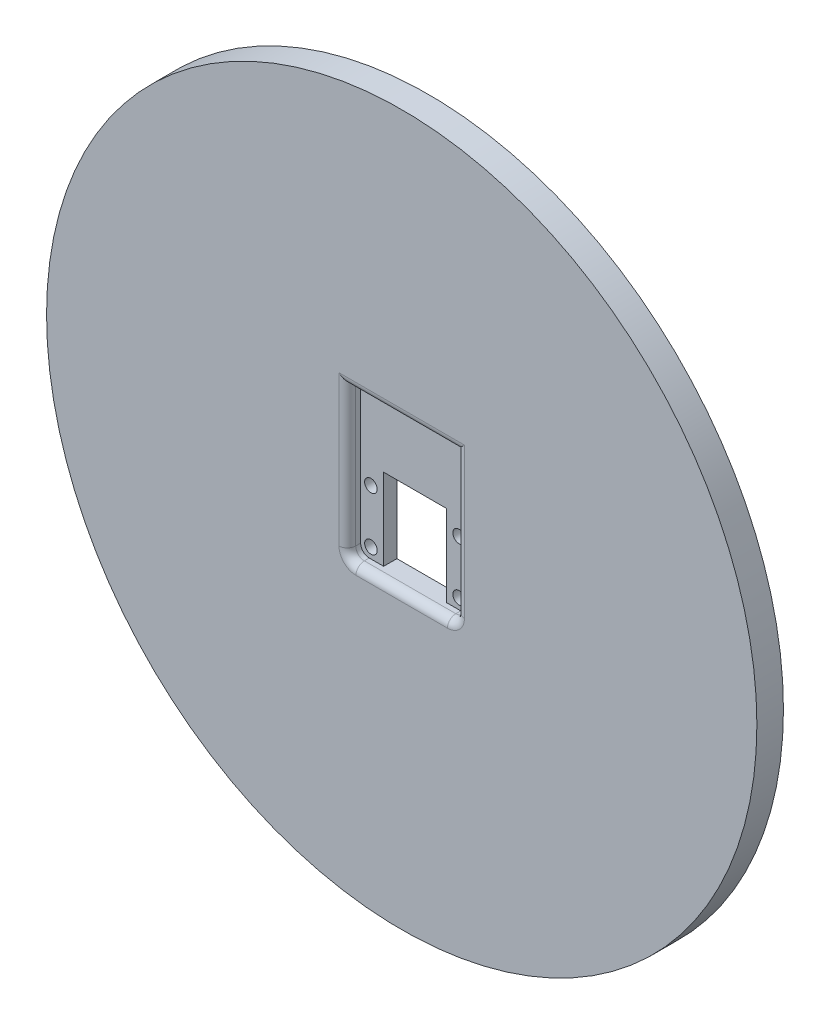
ISO-10303-21;
HEADER;
FILE_DESCRIPTION(('STEP AP214'),'2;1');
FILE_NAME('part.step','',(''),(''),'','','');
FILE_SCHEMA(('AUTOMOTIVE_DESIGN { 1 0 10303 214 1 1 1 1 }'));
ENDSEC;
DATA;
#1=APPLICATION_CONTEXT('core data for automotive mechanical design processes');
#2=APPLICATION_PROTOCOL_DEFINITION('international standard','automotive_design',2000,#1);
#3=PRODUCT_CONTEXT('',#1,'mechanical');
#4=PRODUCT('Part','Part','',(#3));
#5=PRODUCT_RELATED_PRODUCT_CATEGORY('part','',(#4));
#6=PRODUCT_DEFINITION_FORMATION('','',#4);
#7=PRODUCT_DEFINITION_CONTEXT('part definition',#1,'design');
#8=PRODUCT_DEFINITION('design','',#6,#7);
#9=PRODUCT_DEFINITION_SHAPE('','',#8);
#10=(LENGTH_UNIT() NAMED_UNIT(*) SI_UNIT(.MILLI.,.METRE.));
#11=(NAMED_UNIT(*) PLANE_ANGLE_UNIT() SI_UNIT($,.RADIAN.));
#12=(NAMED_UNIT(*) SI_UNIT($,.STERADIAN.) SOLID_ANGLE_UNIT());
#13=UNCERTAINTY_MEASURE_WITH_UNIT(LENGTH_MEASURE(1.E-05),#10,'distance_accuracy_value','');
#14=(GEOMETRIC_REPRESENTATION_CONTEXT(3) GLOBAL_UNCERTAINTY_ASSIGNED_CONTEXT((#13)) GLOBAL_UNIT_ASSIGNED_CONTEXT((#10,
#11,#12)) REPRESENTATION_CONTEXT('',''));
#15=CARTESIAN_POINT('',(0.,0.,0.));
#16=DIRECTION('',(0.,0.,1.));
#17=DIRECTION('',(1.,0.,0.));
#18=AXIS2_PLACEMENT_3D('',#15,#16,#17);
#19=CARTESIAN_POINT('',(0.,0.,6.35));
#20=DIRECTION('',(0.,0.,1.));
#21=DIRECTION('',(1.,0.,0.));
#22=AXIS2_PLACEMENT_3D('',#19,#20,#21);
#23=PLANE('',#22);
#24=DIRECTION('',(-1.,0.,0.));
#25=VECTOR('',#24,1.);
#26=CARTESIAN_POINT('',(13.,22.9426,6.35));
#27=LINE('',#26,#25);
#28=CARTESIAN_POINT('',(-15.,22.9426,6.35));
#29=VERTEX_POINT('',#28);
#30=CARTESIAN_POINT('',(15.,22.9426,6.35));
#31=VERTEX_POINT('',#30);
#32=EDGE_CURVE('E257',#29,#31,#27,.F.);
#33=ORIENTED_EDGE('',*,*,#32,.T.);
#34=DIRECTION('',(0.,1.,0.));
#35=VECTOR('',#34,1.);
#36=CARTESIAN_POINT('',(15.,0.,6.35));
#37=LINE('',#36,#35);
#38=CARTESIAN_POINT('',(15.,-12.9426,6.35));
#39=VERTEX_POINT('',#38);
#40=EDGE_CURVE('E273',#31,#39,#37,.F.);
#41=ORIENTED_EDGE('',*,*,#40,.T.);
#42=CARTESIAN_POINT('',(10.9426,-12.9426,6.35));
#43=DIRECTION('',(0.,0.,1.));
#44=DIRECTION('',(1.,0.,0.));
#45=AXIS2_PLACEMENT_3D('',#42,#43,#44);
#46=CIRCLE('',#45,4.0574);
#47=CARTESIAN_POINT('',(10.9426,-17.,6.35));
#48=VERTEX_POINT('',#47);
#49=EDGE_CURVE('E270',#39,#48,#46,.F.);
#50=ORIENTED_EDGE('',*,*,#49,.T.);
#51=DIRECTION('',(1.,0.,0.));
#52=VECTOR('',#51,1.);
#53=CARTESIAN_POINT('',(0.,-17.,6.35));
#54=LINE('',#53,#52);
#55=CARTESIAN_POINT('',(-10.9426,-17.,6.35));
#56=VERTEX_POINT('',#55);
#57=EDGE_CURVE('E267',#48,#56,#54,.F.);
#58=ORIENTED_EDGE('',*,*,#57,.T.);
#59=CARTESIAN_POINT('',(-10.9426,-12.9426,6.35));
#60=DIRECTION('',(0.,0.,1.));
#61=DIRECTION('',(1.,0.,0.));
#62=AXIS2_PLACEMENT_3D('',#59,#60,#61);
#63=CIRCLE('',#62,4.0574);
#64=CARTESIAN_POINT('',(-15.,-12.9426,6.35));
#65=VERTEX_POINT('',#64);
#66=EDGE_CURVE('E263',#56,#65,#63,.F.);
#67=ORIENTED_EDGE('',*,*,#66,.T.);
#68=DIRECTION('',(0.,-1.,0.));
#69=VECTOR('',#68,1.);
#70=CARTESIAN_POINT('',(-15.,12.9426,6.35));
#71=LINE('',#70,#69);
#72=EDGE_CURVE('E260',#65,#29,#71,.F.);
#73=ORIENTED_EDGE('',*,*,#72,.T.);
#74=EDGE_LOOP('',(#33,#41,#50,#58,#67,#73));
#75=FACE_BOUND('',#74,.T.);
#76=CARTESIAN_POINT('',(0.,0.,6.35));
#77=DIRECTION('',(0.,0.,1.));
#78=DIRECTION('',(1.,0.,0.));
#79=AXIS2_PLACEMENT_3D('',#76,#77,#78);
#80=CIRCLE('',#79,84.93125);
#81=CARTESIAN_POINT('',(84.93125,0.,6.35));
#82=VERTEX_POINT('',#81);
#83=EDGE_CURVE('E237',#82,#82,#80,.T.);
#84=ORIENTED_EDGE('',*,*,#83,.T.);
#85=EDGE_LOOP('',(#84));
#86=FACE_BOUND('',#85,.T.);
#87=ADVANCED_FACE('F47',(#75,#86),#23,.T.);
#88=CARTESIAN_POINT('',(0.,0.,6.35));
#89=DIRECTION('',(0.,0.,-1.));
#90=DIRECTION('',(-1.,0.,0.));
#91=AXIS2_PLACEMENT_3D('',#88,#89,#90);
#92=CYLINDRICAL_SURFACE('',#91,84.93125);
#93=ORIENTED_EDGE('',*,*,#83,.F.);
#94=EDGE_LOOP('',(#93));
#95=FACE_BOUND('',#94,.T.);
#96=CARTESIAN_POINT('',(0.,0.,0.));
#97=DIRECTION('',(0.,0.,1.));
#98=DIRECTION('',(1.,0.,0.));
#99=AXIS2_PLACEMENT_3D('',#96,#97,#98);
#100=CIRCLE('',#99,84.93125);
#101=CARTESIAN_POINT('',(84.93125,0.,0.));
#102=VERTEX_POINT('',#101);
#103=EDGE_CURVE('E218',#102,#102,#100,.T.);
#104=ORIENTED_EDGE('',*,*,#103,.T.);
#105=EDGE_LOOP('',(#104));
#106=FACE_BOUND('',#105,.T.);
#107=ADVANCED_FACE('F397',(#95,#106),#92,.T.);
#108=CARTESIAN_POINT('',(0.,0.,0.));
#109=DIRECTION('',(0.,0.,1.));
#110=DIRECTION('',(1.,0.,0.));
#111=AXIS2_PLACEMENT_3D('',#108,#109,#110);
#112=PLANE('',#111);
#113=DIRECTION('',(-1.,0.,0.));
#114=VECTOR('',#113,1.);
#115=CARTESIAN_POINT('',(7.5,4.5,0.));
#116=LINE('',#115,#114);
#117=CARTESIAN_POINT('',(7.5,4.5,0.));
#118=VERTEX_POINT('',#117);
#119=CARTESIAN_POINT('',(-7.5,4.5,0.));
#120=VERTEX_POINT('',#119);
#121=EDGE_CURVE('E65',#118,#120,#116,.T.);
#122=ORIENTED_EDGE('',*,*,#121,.T.);
#123=DIRECTION('',(0.,1.,0.));
#124=VECTOR('',#123,1.);
#125=CARTESIAN_POINT('',(-7.5,15.,0.));
#126=LINE('',#125,#124);
#127=CARTESIAN_POINT('',(-7.5,-15.,0.));
#128=VERTEX_POINT('',#127);
#129=EDGE_CURVE('E161',#128,#120,#126,.T.);
#130=ORIENTED_EDGE('',*,*,#129,.F.);
#131=DIRECTION('',(-1.,0.,0.));
#132=VECTOR('',#131,1.);
#133=CARTESIAN_POINT('',(7.5,-15.,0.));
#134=LINE('',#133,#132);
#135=CARTESIAN_POINT('',(7.5,-15.,0.));
#136=VERTEX_POINT('',#135);
#137=EDGE_CURVE('E189',#136,#128,#134,.T.);
#138=ORIENTED_EDGE('',*,*,#137,.F.);
#139=DIRECTION('',(0.,-1.,0.));
#140=VECTOR('',#139,1.);
#141=CARTESIAN_POINT('',(7.5,-15.,0.));
#142=LINE('',#141,#140);
#143=EDGE_CURVE('E186',#118,#136,#142,.T.);
#144=ORIENTED_EDGE('',*,*,#143,.F.);
#145=EDGE_LOOP('',(#122,#130,#138,#144));
#146=FACE_BOUND('',#145,.T.);
#147=CARTESIAN_POINT('',(-10.541,-12.5,0.));
#148=DIRECTION('',(0.,0.,1.));
#149=DIRECTION('',(1.,0.,0.));
#150=AXIS2_PLACEMENT_3D('',#147,#148,#149);
#151=CIRCLE('',#150,1.5);
#152=CARTESIAN_POINT('',(-9.041,-12.5,0.));
#153=VERTEX_POINT('',#152);
#154=EDGE_CURVE('E171',#153,#153,#151,.F.);
#155=ORIENTED_EDGE('',*,*,#154,.F.);
#156=EDGE_LOOP('',(#155));
#157=FACE_BOUND('',#156,.T.);
#158=CARTESIAN_POINT('',(10.541,0.200000000000001,0.));
#159=DIRECTION('',(0.,0.,1.));
#160=DIRECTION('',(1.,0.,0.));
#161=AXIS2_PLACEMENT_3D('',#158,#159,#160);
#162=CIRCLE('',#161,1.5);
#163=CARTESIAN_POINT('',(12.041,0.200000000000001,0.));
#164=VERTEX_POINT('',#163);
#165=EDGE_CURVE('E195',#164,#164,#162,.F.);
#166=ORIENTED_EDGE('',*,*,#165,.F.);
#167=EDGE_LOOP('',(#166));
#168=FACE_BOUND('',#167,.T.);
#169=CARTESIAN_POINT('',(-10.541,0.200000000000001,0.));
#170=DIRECTION('',(0.,0.,1.));
#171=DIRECTION('',(1.,0.,0.));
#172=AXIS2_PLACEMENT_3D('',#169,#170,#171);
#173=CIRCLE('',#172,1.5);
#174=CARTESIAN_POINT('',(-9.041,0.200000000000001,0.));
#175=VERTEX_POINT('',#174);
#176=EDGE_CURVE('E318',#175,#175,#173,.F.);
#177=ORIENTED_EDGE('',*,*,#176,.F.);
#178=EDGE_LOOP('',(#177));
#179=FACE_BOUND('',#178,.T.);
#180=CARTESIAN_POINT('',(10.541,-12.5,0.));
#181=DIRECTION('',(0.,0.,1.));
#182=DIRECTION('',(1.,0.,0.));
#183=AXIS2_PLACEMENT_3D('',#180,#181,#182);
#184=CIRCLE('',#183,1.5);
#185=CARTESIAN_POINT('',(12.041,-12.5,0.));
#186=VERTEX_POINT('',#185);
#187=EDGE_CURVE('E200',#186,#186,#184,.F.);
#188=ORIENTED_EDGE('',*,*,#187,.F.);
#189=EDGE_LOOP('',(#188));
#190=FACE_BOUND('',#189,.T.);
#191=ORIENTED_EDGE('',*,*,#103,.F.);
#192=EDGE_LOOP('',(#191));
#193=FACE_BOUND('',#192,.T.);
#194=ADVANCED_FACE('F382',(#146,#157,#168,#179,#190,#193),#112,.F.);
#195=CARTESIAN_POINT('',(10.9426,-12.9426,-39.6988664825584));
#196=DIRECTION('',(0.,0.,1.));
#197=DIRECTION('',(1.,0.,0.));
#198=AXIS2_PLACEMENT_3D('',#195,#196,#197);
#199=CYLINDRICAL_SURFACE('',#198,2.0574);
#200=DIRECTION('',(0.,0.,1.));
#201=VECTOR('',#200,1.);
#202=CARTESIAN_POINT('',(10.9426,-15.,-39.6988664825584));
#203=LINE('',#202,#201);
#204=CARTESIAN_POINT('',(10.9426,-15.,3.175));
#205=VERTEX_POINT('',#204);
#206=CARTESIAN_POINT('',(10.9426,-15.,4.35));
#207=VERTEX_POINT('',#206);
#208=EDGE_CURVE('E204',#205,#207,#203,.T.);
#209=ORIENTED_EDGE('',*,*,#208,.T.);
#210=CARTESIAN_POINT('',(10.9426,-12.9426,4.35));
#211=DIRECTION('',(0.,0.,1.));
#212=DIRECTION('',(1.,0.,0.));
#213=AXIS2_PLACEMENT_3D('',#210,#211,#212);
#214=CIRCLE('',#213,2.0574);
#215=CARTESIAN_POINT('',(13.,-12.9426,4.35));
#216=VERTEX_POINT('',#215);
#217=EDGE_CURVE('E251',#207,#216,#214,.T.);
#218=ORIENTED_EDGE('',*,*,#217,.T.);
#219=DIRECTION('',(0.,0.,1.));
#220=VECTOR('',#219,1.);
#221=CARTESIAN_POINT('',(13.,-12.9426,-39.6988664825584));
#222=LINE('',#221,#220);
#223=CARTESIAN_POINT('',(13.,-12.9426,3.175));
#224=VERTEX_POINT('',#223);
#225=EDGE_CURVE('E222',#224,#216,#222,.T.);
#226=ORIENTED_EDGE('',*,*,#225,.F.);
#227=CARTESIAN_POINT('',(10.9426,-12.9426,3.175));
#228=DIRECTION('',(0.,0.,1.));
#229=DIRECTION('',(1.,0.,0.));
#230=AXIS2_PLACEMENT_3D('',#227,#228,#229);
#231=CIRCLE('',#230,2.0574);
#232=EDGE_CURVE('E209',#205,#224,#231,.T.);
#233=ORIENTED_EDGE('',*,*,#232,.F.);
#234=EDGE_LOOP('',(#209,#218,#226,#233));
#235=FACE_BOUND('',#234,.T.);
#236=ADVANCED_FACE('F340',(#235),#199,.F.);
#237=CARTESIAN_POINT('',(13.,12.9426,-39.6988664825584));
#238=DIRECTION('',(-1.,0.,0.));
#239=DIRECTION('',(0.,-1.,0.));
#240=AXIS2_PLACEMENT_3D('',#237,#238,#239);
#241=PLANE('',#240);
#242=ORIENTED_EDGE('',*,*,#225,.T.);
#243=DIRECTION('',(0.,1.,0.));
#244=VECTOR('',#243,1.);
#245=CARTESIAN_POINT('',(13.,12.9426,4.35));
#246=LINE('',#245,#244);
#247=CARTESIAN_POINT('',(13.,20.9426,4.35));
#248=VERTEX_POINT('',#247);
#249=EDGE_CURVE('E254',#216,#248,#246,.T.);
#250=ORIENTED_EDGE('',*,*,#249,.T.);
#251=DIRECTION('',(0.,0.,1.));
#252=VECTOR('',#251,1.);
#253=CARTESIAN_POINT('',(13.,20.9426,-24.0279410174709));
#254=LINE('',#253,#252);
#255=CARTESIAN_POINT('',(13.,20.9426,3.175));
#256=VERTEX_POINT('',#255);
#257=EDGE_CURVE('E300',#256,#248,#254,.T.);
#258=ORIENTED_EDGE('',*,*,#257,.F.);
#259=DIRECTION('',(0.,1.,0.));
#260=VECTOR('',#259,1.);
#261=CARTESIAN_POINT('',(13.,12.9426,3.175));
#262=LINE('',#261,#260);
#263=EDGE_CURVE('E205',#224,#256,#262,.T.);
#264=ORIENTED_EDGE('',*,*,#263,.F.);
#265=EDGE_LOOP('',(#242,#250,#258,#264));
#266=FACE_BOUND('',#265,.T.);
#267=ADVANCED_FACE('F364',(#266),#241,.T.);
#268=CARTESIAN_POINT('',(-13.,12.9426,-39.6988664825584));
#269=DIRECTION('',(-1.,0.,0.));
#270=DIRECTION('',(0.,-1.,0.));
#271=AXIS2_PLACEMENT_3D('',#268,#269,#270);
#272=PLANE('',#271);
#273=DIRECTION('',(0.,0.,1.));
#274=VECTOR('',#273,1.);
#275=CARTESIAN_POINT('',(-13.,20.9426,-24.0279410174709));
#276=LINE('',#275,#274);
#277=CARTESIAN_POINT('',(-13.,20.9426,3.175));
#278=VERTEX_POINT('',#277);
#279=CARTESIAN_POINT('',(-13.,20.9426,4.35));
#280=VERTEX_POINT('',#279);
#281=EDGE_CURVE('E305',#278,#280,#276,.T.);
#282=ORIENTED_EDGE('',*,*,#281,.T.);
#283=DIRECTION('',(0.,-1.,0.));
#284=VECTOR('',#283,1.);
#285=CARTESIAN_POINT('',(-13.,12.9426,4.35));
#286=LINE('',#285,#284);
#287=CARTESIAN_POINT('',(-13.,-12.9426,4.35));
#288=VERTEX_POINT('',#287);
#289=EDGE_CURVE('E57',#280,#288,#286,.T.);
#290=ORIENTED_EDGE('',*,*,#289,.T.);
#291=DIRECTION('',(0.,0.,1.));
#292=VECTOR('',#291,1.);
#293=CARTESIAN_POINT('',(-13.,-12.9426,-39.6988664825584));
#294=LINE('',#293,#292);
#295=CARTESIAN_POINT('',(-13.,-12.9426,3.175));
#296=VERTEX_POINT('',#295);
#297=EDGE_CURVE('E226',#296,#288,#294,.T.);
#298=ORIENTED_EDGE('',*,*,#297,.F.);
#299=DIRECTION('',(0.,1.,0.));
#300=VECTOR('',#299,1.);
#301=CARTESIAN_POINT('',(-13.,12.9426,3.175));
#302=LINE('',#301,#300);
#303=EDGE_CURVE('E208',#296,#278,#302,.T.);
#304=ORIENTED_EDGE('',*,*,#303,.T.);
#305=EDGE_LOOP('',(#282,#290,#298,#304));
#306=FACE_BOUND('',#305,.T.);
#307=ADVANCED_FACE('F372',(#306),#272,.F.);
#308=CARTESIAN_POINT('',(-10.9426,-12.9426,-39.6988664825584));
#309=DIRECTION('',(0.,0.,1.));
#310=DIRECTION('',(1.,0.,0.));
#311=AXIS2_PLACEMENT_3D('',#308,#309,#310);
#312=CYLINDRICAL_SURFACE('',#311,2.0574);
#313=ORIENTED_EDGE('',*,*,#297,.T.);
#314=CARTESIAN_POINT('',(-10.9426,-12.9426,4.35));
#315=DIRECTION('',(0.,0.,1.));
#316=DIRECTION('',(1.,0.,0.));
#317=AXIS2_PLACEMENT_3D('',#314,#315,#316);
#318=CIRCLE('',#317,2.0574);
#319=CARTESIAN_POINT('',(-10.9426,-15.,4.35));
#320=VERTEX_POINT('',#319);
#321=EDGE_CURVE('E241',#288,#320,#318,.T.);
#322=ORIENTED_EDGE('',*,*,#321,.T.);
#323=DIRECTION('',(0.,0.,1.));
#324=VECTOR('',#323,1.);
#325=CARTESIAN_POINT('',(-10.9426,-15.,-39.6988664825584));
#326=LINE('',#325,#324);
#327=CARTESIAN_POINT('',(-10.9426,-15.,3.175));
#328=VERTEX_POINT('',#327);
#329=EDGE_CURVE('E230',#328,#320,#326,.T.);
#330=ORIENTED_EDGE('',*,*,#329,.F.);
#331=CARTESIAN_POINT('',(-10.9426,-12.9426,3.175));
#332=DIRECTION('',(0.,0.,1.));
#333=DIRECTION('',(1.,0.,0.));
#334=AXIS2_PLACEMENT_3D('',#331,#332,#333);
#335=CIRCLE('',#334,2.0574);
#336=EDGE_CURVE('E212',#296,#328,#335,.T.);
#337=ORIENTED_EDGE('',*,*,#336,.F.);
#338=EDGE_LOOP('',(#313,#322,#330,#337));
#339=FACE_BOUND('',#338,.T.);
#340=ADVANCED_FACE('F351',(#339),#312,.F.);
#341=CARTESIAN_POINT('',(10.9426,-15.,-39.6988664825584));
#342=DIRECTION('',(0.,1.,0.));
#343=DIRECTION('',(-1.,0.,0.));
#344=AXIS2_PLACEMENT_3D('',#341,#342,#343);
#345=PLANE('',#344);
#346=ORIENTED_EDGE('',*,*,#329,.T.);
#347=DIRECTION('',(1.,0.,0.));
#348=VECTOR('',#347,1.);
#349=CARTESIAN_POINT('',(10.9426,-15.,4.35));
#350=LINE('',#349,#348);
#351=EDGE_CURVE('E248',#320,#207,#350,.T.);
#352=ORIENTED_EDGE('',*,*,#351,.T.);
#353=ORIENTED_EDGE('',*,*,#208,.F.);
#354=DIRECTION('',(1.,0.,0.));
#355=VECTOR('',#354,1.);
#356=CARTESIAN_POINT('',(10.9426,-15.,3.175));
#357=LINE('',#356,#355);
#358=CARTESIAN_POINT('',(7.5,-15.,3.175));
#359=VERTEX_POINT('',#358);
#360=EDGE_CURVE('E215',#359,#205,#357,.T.);
#361=ORIENTED_EDGE('',*,*,#360,.F.);
#362=DIRECTION('',(0.,0.,1.));
#363=VECTOR('',#362,1.);
#364=CARTESIAN_POINT('',(7.5,-15.,-33.5410196624969));
#365=LINE('',#364,#363);
#366=EDGE_CURVE('E183',#136,#359,#365,.T.);
#367=ORIENTED_EDGE('',*,*,#366,.F.);
#368=ORIENTED_EDGE('',*,*,#137,.T.);
#369=DIRECTION('',(0.,0.,1.));
#370=VECTOR('',#369,1.);
#371=CARTESIAN_POINT('',(-7.5,-15.,-33.5410196624969));
#372=LINE('',#371,#370);
#373=CARTESIAN_POINT('',(-7.5,-15.,3.175));
#374=VERTEX_POINT('',#373);
#375=EDGE_CURVE('E175',#128,#374,#372,.T.);
#376=ORIENTED_EDGE('',*,*,#375,.T.);
#377=EDGE_CURVE('E168',#328,#374,#357,.T.);
#378=ORIENTED_EDGE('',*,*,#377,.F.);
#379=EDGE_LOOP('',(#346,#352,#353,#361,#367,#368,#376,#378));
#380=FACE_BOUND('',#379,.T.);
#381=ADVANCED_FACE('F341',(#380),#345,.T.);
#382=CARTESIAN_POINT('',(0.,0.,3.175));
#383=DIRECTION('',(0.,0.,1.));
#384=DIRECTION('',(1.,0.,0.));
#385=AXIS2_PLACEMENT_3D('',#382,#383,#384);
#386=PLANE('',#385);
#387=DIRECTION('',(0.,-1.,0.));
#388=VECTOR('',#387,1.);
#389=CARTESIAN_POINT('',(-7.5,15.,3.175));
#390=LINE('',#389,#388);
#391=CARTESIAN_POINT('',(-7.5,4.5,3.175));
#392=VERTEX_POINT('',#391);
#393=EDGE_CURVE('E158',#392,#374,#390,.T.);
#394=ORIENTED_EDGE('',*,*,#393,.F.);
#395=DIRECTION('',(-1.,0.,0.));
#396=VECTOR('',#395,1.);
#397=CARTESIAN_POINT('',(7.5,4.5,3.175));
#398=LINE('',#397,#396);
#399=CARTESIAN_POINT('',(7.5,4.5,3.175));
#400=VERTEX_POINT('',#399);
#401=EDGE_CURVE('E143',#400,#392,#398,.T.);
#402=ORIENTED_EDGE('',*,*,#401,.F.);
#403=DIRECTION('',(0.,1.,0.));
#404=VECTOR('',#403,1.);
#405=CARTESIAN_POINT('',(7.5,-15.,3.175));
#406=LINE('',#405,#404);
#407=EDGE_CURVE('E170',#359,#400,#406,.T.);
#408=ORIENTED_EDGE('',*,*,#407,.F.);
#409=ORIENTED_EDGE('',*,*,#360,.T.);
#410=ORIENTED_EDGE('',*,*,#232,.T.);
#411=ORIENTED_EDGE('',*,*,#263,.T.);
#412=DIRECTION('',(1.,0.,0.));
#413=VECTOR('',#412,1.);
#414=CARTESIAN_POINT('',(-13.,20.9426,3.175));
#415=LINE('',#414,#413);
#416=EDGE_CURVE('E310',#278,#256,#415,.T.);
#417=ORIENTED_EDGE('',*,*,#416,.F.);
#418=ORIENTED_EDGE('',*,*,#303,.F.);
#419=ORIENTED_EDGE('',*,*,#336,.T.);
#420=ORIENTED_EDGE('',*,*,#377,.T.);
#421=EDGE_LOOP('',(#394,#402,#408,#409,#410,#411,#417,#418,#419,#420));
#422=FACE_BOUND('',#421,.T.);
#423=CARTESIAN_POINT('',(10.541,0.200000000000001,3.175));
#424=DIRECTION('',(0.,0.,1.));
#425=DIRECTION('',(1.,0.,0.));
#426=AXIS2_PLACEMENT_3D('',#423,#424,#425);
#427=CIRCLE('',#426,1.5);
#428=CARTESIAN_POINT('',(12.041,0.200000000000001,3.175));
#429=VERTEX_POINT('',#428);
#430=EDGE_CURVE('E314',#429,#429,#427,.T.);
#431=ORIENTED_EDGE('',*,*,#430,.F.);
#432=EDGE_LOOP('',(#431));
#433=FACE_BOUND('',#432,.T.);
#434=CARTESIAN_POINT('',(10.541,-12.5,3.175));
#435=DIRECTION('',(0.,0.,1.));
#436=DIRECTION('',(1.,0.,0.));
#437=AXIS2_PLACEMENT_3D('',#434,#435,#436);
#438=CIRCLE('',#437,1.5);
#439=CARTESIAN_POINT('',(12.041,-12.5,3.175));
#440=VERTEX_POINT('',#439);
#441=EDGE_CURVE('E192',#440,#440,#438,.T.);
#442=ORIENTED_EDGE('',*,*,#441,.F.);
#443=EDGE_LOOP('',(#442));
#444=FACE_BOUND('',#443,.T.);
#445=CARTESIAN_POINT('',(-10.541,0.200000000000001,3.175));
#446=DIRECTION('',(0.,0.,1.));
#447=DIRECTION('',(1.,0.,0.));
#448=AXIS2_PLACEMENT_3D('',#445,#446,#447);
#449=CIRCLE('',#448,1.5);
#450=CARTESIAN_POINT('',(-9.041,0.200000000000001,3.175));
#451=VERTEX_POINT('',#450);
#452=EDGE_CURVE('E322',#451,#451,#449,.T.);
#453=ORIENTED_EDGE('',*,*,#452,.F.);
#454=EDGE_LOOP('',(#453));
#455=FACE_BOUND('',#454,.T.);
#456=CARTESIAN_POINT('',(-10.541,-12.5,3.175));
#457=DIRECTION('',(0.,0.,1.));
#458=DIRECTION('',(1.,0.,0.));
#459=AXIS2_PLACEMENT_3D('',#456,#457,#458);
#460=CIRCLE('',#459,1.5);
#461=CARTESIAN_POINT('',(-9.041,-12.5,3.175));
#462=VERTEX_POINT('',#461);
#463=EDGE_CURVE('E178',#462,#462,#460,.T.);
#464=ORIENTED_EDGE('',*,*,#463,.F.);
#465=EDGE_LOOP('',(#464));
#466=FACE_BOUND('',#465,.T.);
#467=ADVANCED_FACE('F165',(#422,#433,#444,#455,#466),#386,.T.);
#468=CARTESIAN_POINT('',(10.541,-12.5,-33.5410196624969));
#469=DIRECTION('',(0.,0.,1.));
#470=DIRECTION('',(1.,0.,0.));
#471=AXIS2_PLACEMENT_3D('',#468,#469,#470);
#472=CYLINDRICAL_SURFACE('',#471,1.5);
#473=ORIENTED_EDGE('',*,*,#187,.T.);
#474=EDGE_LOOP('',(#473));
#475=FACE_BOUND('',#474,.T.);
#476=ORIENTED_EDGE('',*,*,#441,.T.);
#477=EDGE_LOOP('',(#476));
#478=FACE_BOUND('',#477,.T.);
#479=ADVANCED_FACE('F512',(#475,#478),#472,.F.);
#480=CARTESIAN_POINT('',(-10.541,0.200000000000001,-33.5410196624969));
#481=DIRECTION('',(0.,0.,1.));
#482=DIRECTION('',(1.,0.,0.));
#483=AXIS2_PLACEMENT_3D('',#480,#481,#482);
#484=CYLINDRICAL_SURFACE('',#483,1.5);
#485=ORIENTED_EDGE('',*,*,#176,.T.);
#486=EDGE_LOOP('',(#485));
#487=FACE_BOUND('',#486,.T.);
#488=ORIENTED_EDGE('',*,*,#452,.T.);
#489=EDGE_LOOP('',(#488));
#490=FACE_BOUND('',#489,.T.);
#491=ADVANCED_FACE('F501',(#487,#490),#484,.F.);
#492=CARTESIAN_POINT('',(10.541,0.200000000000001,-33.5410196624969));
#493=DIRECTION('',(0.,0.,1.));
#494=DIRECTION('',(1.,0.,0.));
#495=AXIS2_PLACEMENT_3D('',#492,#493,#494);
#496=CYLINDRICAL_SURFACE('',#495,1.5);
#497=ORIENTED_EDGE('',*,*,#165,.T.);
#498=EDGE_LOOP('',(#497));
#499=FACE_BOUND('',#498,.T.);
#500=ORIENTED_EDGE('',*,*,#430,.T.);
#501=EDGE_LOOP('',(#500));
#502=FACE_BOUND('',#501,.T.);
#503=ADVANCED_FACE('F489',(#499,#502),#496,.F.);
#504=CARTESIAN_POINT('',(-10.541,-12.5,-33.5410196624969));
#505=DIRECTION('',(0.,0.,1.));
#506=DIRECTION('',(1.,0.,0.));
#507=AXIS2_PLACEMENT_3D('',#504,#505,#506);
#508=CYLINDRICAL_SURFACE('',#507,1.5);
#509=ORIENTED_EDGE('',*,*,#154,.T.);
#510=EDGE_LOOP('',(#509));
#511=FACE_BOUND('',#510,.T.);
#512=ORIENTED_EDGE('',*,*,#463,.T.);
#513=EDGE_LOOP('',(#512));
#514=FACE_BOUND('',#513,.T.);
#515=ADVANCED_FACE('F393',(#511,#514),#508,.F.);
#516=CARTESIAN_POINT('',(-7.5,15.,-33.5410196624969));
#517=DIRECTION('',(-1.,0.,0.));
#518=DIRECTION('',(0.,0.,1.));
#519=AXIS2_PLACEMENT_3D('',#516,#517,#518);
#520=PLANE('',#519);
#521=ORIENTED_EDGE('',*,*,#129,.T.);
#522=DIRECTION('',(0.,0.,-1.));
#523=VECTOR('',#522,1.);
#524=CARTESIAN_POINT('',(-7.5,4.5,21.4848334236006));
#525=LINE('',#524,#523);
#526=EDGE_CURVE('E146',#392,#120,#525,.T.);
#527=ORIENTED_EDGE('',*,*,#526,.F.);
#528=ORIENTED_EDGE('',*,*,#393,.T.);
#529=ORIENTED_EDGE('',*,*,#375,.F.);
#530=EDGE_LOOP('',(#521,#527,#528,#529));
#531=FACE_BOUND('',#530,.T.);
#532=ADVANCED_FACE('F156',(#531),#520,.F.);
#533=CARTESIAN_POINT('',(7.5,-15.,-33.5410196624969));
#534=DIRECTION('',(1.,0.,0.));
#535=DIRECTION('',(0.,0.,-1.));
#536=AXIS2_PLACEMENT_3D('',#533,#534,#535);
#537=PLANE('',#536);
#538=ORIENTED_EDGE('',*,*,#407,.T.);
#539=DIRECTION('',(0.,0.,-1.));
#540=VECTOR('',#539,1.);
#541=CARTESIAN_POINT('',(7.5,4.5,21.4848334236006));
#542=LINE('',#541,#540);
#543=EDGE_CURVE('E147',#400,#118,#542,.T.);
#544=ORIENTED_EDGE('',*,*,#543,.T.);
#545=ORIENTED_EDGE('',*,*,#143,.T.);
#546=ORIENTED_EDGE('',*,*,#366,.T.);
#547=EDGE_LOOP('',(#538,#544,#545,#546));
#548=FACE_BOUND('',#547,.T.);
#549=ADVANCED_FACE('F385',(#548),#537,.F.);
#550=CARTESIAN_POINT('',(-13.,20.9426,-24.0279410174709));
#551=DIRECTION('',(0.,1.,0.));
#552=DIRECTION('',(0.,0.,1.));
#553=AXIS2_PLACEMENT_3D('',#550,#551,#552);
#554=PLANE('',#553);
#555=ORIENTED_EDGE('',*,*,#257,.T.);
#556=DIRECTION('',(-1.,0.,0.));
#557=VECTOR('',#556,1.);
#558=CARTESIAN_POINT('',(-13.,20.9426,4.35));
#559=LINE('',#558,#557);
#560=EDGE_CURVE('E12',#248,#280,#559,.T.);
#561=ORIENTED_EDGE('',*,*,#560,.T.);
#562=ORIENTED_EDGE('',*,*,#281,.F.);
#563=ORIENTED_EDGE('',*,*,#416,.T.);
#564=EDGE_LOOP('',(#555,#561,#562,#563));
#565=FACE_BOUND('',#564,.T.);
#566=ADVANCED_FACE('F375',(#565),#554,.F.);
#567=CARTESIAN_POINT('',(15.,12.9426,4.35));
#568=DIRECTION('',(0.,1.,0.));
#569=DIRECTION('',(-1.,0.,0.));
#570=AXIS2_PLACEMENT_3D('',#567,#568,#569);
#571=CYLINDRICAL_SURFACE('',#570,2.);
#572=CARTESIAN_POINT('',(15.,-12.9426,4.35));
#573=DIRECTION('',(0.,-1.,0.));
#574=DIRECTION('',(0.,0.,-1.));
#575=AXIS2_PLACEMENT_3D('',#572,#573,#574);
#576=CIRCLE('',#575,2.);
#577=EDGE_CURVE('E291',#39,#216,#576,.T.);
#578=ORIENTED_EDGE('',*,*,#577,.F.);
#579=ORIENTED_EDGE('',*,*,#40,.F.);
#580=CARTESIAN_POINT('',(15.,22.9426,4.35));
#581=DIRECTION('',(-0.707106781186548,0.707106781186547,0.));
#582=DIRECTION('',(0.707106781186547,0.707106781186548,0.));
#583=AXIS2_PLACEMENT_3D('',#580,#581,#582);
#584=ELLIPSE('',#583,2.82842712474619,2.);
#585=EDGE_CURVE('E51',#248,#31,#584,.T.);
#586=ORIENTED_EDGE('',*,*,#585,.F.);
#587=ORIENTED_EDGE('',*,*,#249,.F.);
#588=EDGE_LOOP('',(#578,#579,#586,#587));
#589=FACE_BOUND('',#588,.T.);
#590=ADVANCED_FACE('F49',(#589),#571,.T.);
#591=CARTESIAN_POINT('',(-13.,22.9426,4.35));
#592=DIRECTION('',(1.,0.,0.));
#593=DIRECTION('',(0.,0.,-1.));
#594=AXIS2_PLACEMENT_3D('',#591,#592,#593);
#595=CYLINDRICAL_SURFACE('',#594,2.);
#596=ORIENTED_EDGE('',*,*,#585,.T.);
#597=ORIENTED_EDGE('',*,*,#32,.F.);
#598=CARTESIAN_POINT('',(-15.,22.9426,4.35));
#599=DIRECTION('',(0.707106781186547,0.707106781186548,0.));
#600=DIRECTION('',(-0.707106781186548,0.707106781186547,0.));
#601=AXIS2_PLACEMENT_3D('',#598,#599,#600);
#602=ELLIPSE('',#601,2.82842712474619,2.);
#603=EDGE_CURVE('E288',#280,#29,#602,.F.);
#604=ORIENTED_EDGE('',*,*,#603,.F.);
#605=ORIENTED_EDGE('',*,*,#560,.F.);
#606=EDGE_LOOP('',(#596,#597,#604,#605));
#607=FACE_BOUND('',#606,.T.);
#608=ADVANCED_FACE('F367',(#607),#595,.T.);
#609=CARTESIAN_POINT('',(10.9426,-12.9426,4.35));
#610=DIRECTION('',(0.,0.,1.));
#611=DIRECTION('',(1.,0.,0.));
#612=AXIS2_PLACEMENT_3D('',#609,#610,#611);
#613=TOROIDAL_SURFACE('',#612,4.0574,2.);
#614=ORIENTED_EDGE('',*,*,#577,.T.);
#615=ORIENTED_EDGE('',*,*,#217,.F.);
#616=CARTESIAN_POINT('',(10.9426,-17.,4.35));
#617=DIRECTION('',(-1.,0.,0.));
#618=DIRECTION('',(0.,0.,1.));
#619=AXIS2_PLACEMENT_3D('',#616,#617,#618);
#620=CIRCLE('',#619,2.);
#621=EDGE_CURVE('E284',#48,#207,#620,.T.);
#622=ORIENTED_EDGE('',*,*,#621,.F.);
#623=ORIENTED_EDGE('',*,*,#49,.F.);
#624=EDGE_LOOP('',(#614,#615,#622,#623));
#625=FACE_BOUND('',#624,.T.);
#626=ADVANCED_FACE('F361',(#625),#613,.T.);
#627=CARTESIAN_POINT('',(-15.,12.9426,4.35));
#628=DIRECTION('',(0.,1.,0.));
#629=DIRECTION('',(-1.,0.,0.));
#630=AXIS2_PLACEMENT_3D('',#627,#628,#629);
#631=CYLINDRICAL_SURFACE('',#630,2.);
#632=ORIENTED_EDGE('',*,*,#603,.T.);
#633=ORIENTED_EDGE('',*,*,#72,.F.);
#634=CARTESIAN_POINT('',(-15.,-12.9426,4.35));
#635=DIRECTION('',(0.,-1.,0.));
#636=DIRECTION('',(0.,0.,-1.));
#637=AXIS2_PLACEMENT_3D('',#634,#635,#636);
#638=CIRCLE('',#637,2.);
#639=EDGE_CURVE('E281',#288,#65,#638,.T.);
#640=ORIENTED_EDGE('',*,*,#639,.F.);
#641=ORIENTED_EDGE('',*,*,#289,.F.);
#642=EDGE_LOOP('',(#632,#633,#640,#641));
#643=FACE_BOUND('',#642,.T.);
#644=ADVANCED_FACE('F370',(#643),#631,.T.);
#645=CARTESIAN_POINT('',(10.9426,-17.,4.35));
#646=DIRECTION('',(1.,0.,0.));
#647=DIRECTION('',(0.,1.,0.));
#648=AXIS2_PLACEMENT_3D('',#645,#646,#647);
#649=CYLINDRICAL_SURFACE('',#648,2.);
#650=ORIENTED_EDGE('',*,*,#621,.T.);
#651=ORIENTED_EDGE('',*,*,#351,.F.);
#652=CARTESIAN_POINT('',(-10.9426,-17.,4.35));
#653=DIRECTION('',(-1.,0.,0.));
#654=DIRECTION('',(0.,0.,1.));
#655=AXIS2_PLACEMENT_3D('',#652,#653,#654);
#656=CIRCLE('',#655,2.);
#657=EDGE_CURVE('E278',#56,#320,#656,.T.);
#658=ORIENTED_EDGE('',*,*,#657,.F.);
#659=ORIENTED_EDGE('',*,*,#57,.F.);
#660=EDGE_LOOP('',(#650,#651,#658,#659));
#661=FACE_BOUND('',#660,.T.);
#662=ADVANCED_FACE('F346',(#661),#649,.T.);
#663=CARTESIAN_POINT('',(-10.9426,-12.9426,4.35));
#664=DIRECTION('',(0.,0.,1.));
#665=DIRECTION('',(1.,0.,0.));
#666=AXIS2_PLACEMENT_3D('',#663,#664,#665);
#667=TOROIDAL_SURFACE('',#666,4.0574,2.);
#668=ORIENTED_EDGE('',*,*,#639,.T.);
#669=ORIENTED_EDGE('',*,*,#66,.F.);
#670=ORIENTED_EDGE('',*,*,#657,.T.);
#671=ORIENTED_EDGE('',*,*,#321,.F.);
#672=EDGE_LOOP('',(#668,#669,#670,#671));
#673=FACE_BOUND('',#672,.T.);
#674=ADVANCED_FACE('F355',(#673),#667,.T.);
#675=CARTESIAN_POINT('',(7.5,4.5,21.4848334236006));
#676=DIRECTION('',(0.,-1.,0.));
#677=DIRECTION('',(0.,0.,-1.));
#678=AXIS2_PLACEMENT_3D('',#675,#676,#677);
#679=PLANE('',#678);
#680=ORIENTED_EDGE('',*,*,#543,.F.);
#681=ORIENTED_EDGE('',*,*,#401,.T.);
#682=ORIENTED_EDGE('',*,*,#526,.T.);
#683=ORIENTED_EDGE('',*,*,#121,.F.);
#684=EDGE_LOOP('',(#680,#681,#682,#683));
#685=FACE_BOUND('',#684,.T.);
#686=ADVANCED_FACE('F145',(#685),#679,.T.);
#687=CLOSED_SHELL('',(#87,#107,#194,#236,#267,#307,#340,#381,#467,#479,#491,#503,#515,#532,#549,
#566,#590,#608,#626,#644,#662,#674,#686));
#688=MANIFOLD_SOLID_BREP('B2',#687);
#689=ADVANCED_BREP_SHAPE_REPRESENTATION('',(#18,#688),#14);
#690=SHAPE_DEFINITION_REPRESENTATION(#9,#689);
ENDSEC;
END-ISO-10303-21;
